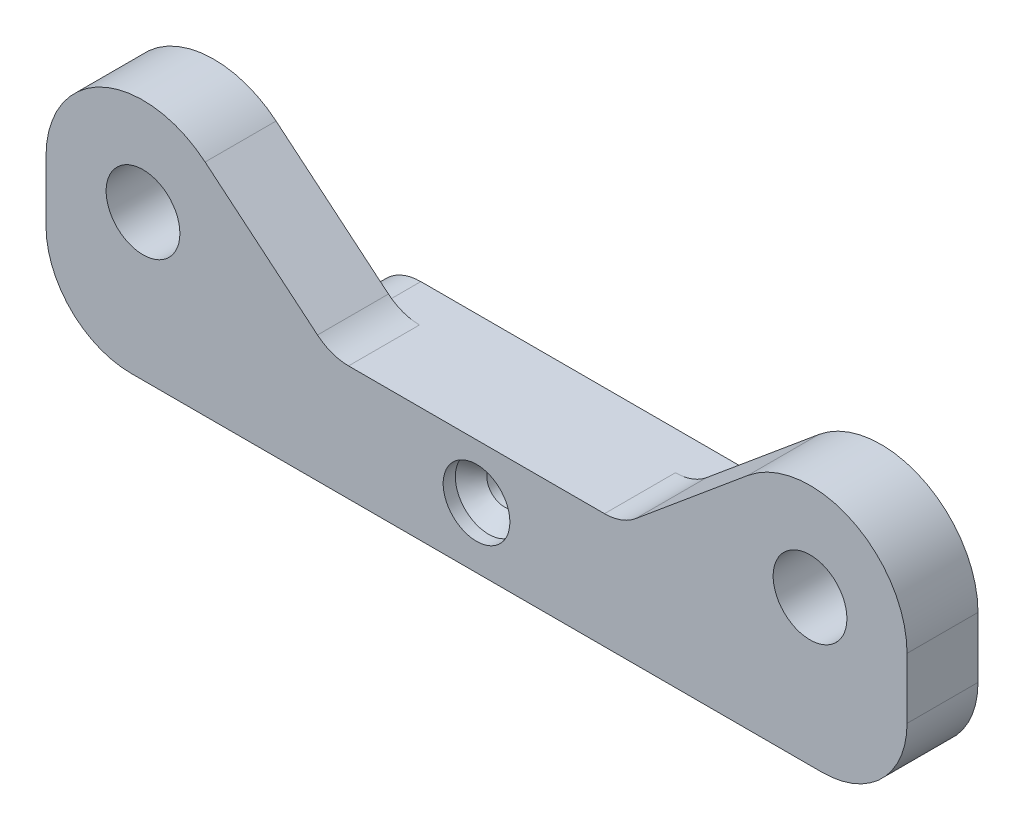
ISO-10303-21;
HEADER;
FILE_DESCRIPTION(('STEP AP214'),'2;1');
FILE_NAME('part.step','',(''),(''),'','','');
FILE_SCHEMA(('AUTOMOTIVE_DESIGN { 1 0 10303 214 1 1 1 1 }'));
ENDSEC;
DATA;
#1=APPLICATION_CONTEXT('core data for automotive mechanical design processes');
#2=APPLICATION_PROTOCOL_DEFINITION('international standard','automotive_design',2000,#1);
#3=PRODUCT_CONTEXT('',#1,'mechanical');
#4=PRODUCT('Part','Part','',(#3));
#5=PRODUCT_RELATED_PRODUCT_CATEGORY('part','',(#4));
#6=PRODUCT_DEFINITION_FORMATION('','',#4);
#7=PRODUCT_DEFINITION_CONTEXT('part definition',#1,'design');
#8=PRODUCT_DEFINITION('design','',#6,#7);
#9=PRODUCT_DEFINITION_SHAPE('','',#8);
#10=(LENGTH_UNIT() NAMED_UNIT(*) SI_UNIT(.MILLI.,.METRE.));
#11=(NAMED_UNIT(*) PLANE_ANGLE_UNIT() SI_UNIT($,.RADIAN.));
#12=(NAMED_UNIT(*) SI_UNIT($,.STERADIAN.) SOLID_ANGLE_UNIT());
#13=UNCERTAINTY_MEASURE_WITH_UNIT(LENGTH_MEASURE(1.E-05),#10,'distance_accuracy_value','');
#14=(GEOMETRIC_REPRESENTATION_CONTEXT(3) GLOBAL_UNCERTAINTY_ASSIGNED_CONTEXT((#13)) GLOBAL_UNIT_ASSIGNED_CONTEXT((#10,
#11,#12)) REPRESENTATION_CONTEXT('',''));
#15=CARTESIAN_POINT('',(0.,0.,0.));
#16=DIRECTION('',(0.,0.,1.));
#17=DIRECTION('',(1.,0.,0.));
#18=AXIS2_PLACEMENT_3D('',#15,#16,#17);
#19=CARTESIAN_POINT('',(15.,0.,9.));
#20=DIRECTION('',(0.,0.,1.));
#21=DIRECTION('',(1.,0.,0.));
#22=AXIS2_PLACEMENT_3D('',#19,#20,#21);
#23=CYLINDRICAL_SURFACE('',#22,0.999999999999997);
#24=CARTESIAN_POINT('',(15.,0.,0.));
#25=DIRECTION('',(0.,0.,-1.));
#26=DIRECTION('',(-1.,0.,0.));
#27=AXIS2_PLACEMENT_3D('',#24,#25,#26);
#28=CIRCLE('',#27,0.999999999999997);
#29=CARTESIAN_POINT('',(14.,0.,0.));
#30=VERTEX_POINT('',#29);
#31=EDGE_CURVE('E308',#30,#30,#28,.T.);
#32=ORIENTED_EDGE('',*,*,#31,.T.);
#33=EDGE_LOOP('',(#32));
#34=FACE_BOUND('',#33,.T.);
#35=CARTESIAN_POINT('',(15.,0.,7.));
#36=DIRECTION('',(0.,0.,1.));
#37=DIRECTION('',(1.,0.,0.));
#38=AXIS2_PLACEMENT_3D('',#35,#36,#37);
#39=CIRCLE('',#38,0.999999999999997);
#40=CARTESIAN_POINT('',(16.,0.,7.));
#41=VERTEX_POINT('',#40);
#42=EDGE_CURVE('E347',#41,#41,#39,.F.);
#43=ORIENTED_EDGE('',*,*,#42,.F.);
#44=EDGE_LOOP('',(#43));
#45=FACE_BOUND('',#44,.T.);
#46=ADVANCED_FACE('F36',(#34,#45),#23,.F.);
#47=CARTESIAN_POINT('',(-15.,0.,9.));
#48=DIRECTION('',(0.,0.,1.));
#49=DIRECTION('',(1.,0.,0.));
#50=AXIS2_PLACEMENT_3D('',#47,#48,#49);
#51=CYLINDRICAL_SURFACE('',#50,0.999999999999994);
#52=CARTESIAN_POINT('',(-15.,0.,0.));
#53=DIRECTION('',(0.,0.,-1.));
#54=DIRECTION('',(-1.,0.,0.));
#55=AXIS2_PLACEMENT_3D('',#52,#53,#54);
#56=CIRCLE('',#55,0.999999999999994);
#57=CARTESIAN_POINT('',(-16.,0.,0.));
#58=VERTEX_POINT('',#57);
#59=EDGE_CURVE('E311',#58,#58,#56,.T.);
#60=ORIENTED_EDGE('',*,*,#59,.T.);
#61=EDGE_LOOP('',(#60));
#62=FACE_BOUND('',#61,.T.);
#63=CARTESIAN_POINT('',(-15.,0.,7.));
#64=DIRECTION('',(0.,0.,1.));
#65=DIRECTION('',(1.,0.,0.));
#66=AXIS2_PLACEMENT_3D('',#63,#64,#65);
#67=CIRCLE('',#66,0.999999999999994);
#68=CARTESIAN_POINT('',(-14.,0.,7.));
#69=VERTEX_POINT('',#68);
#70=EDGE_CURVE('E344',#69,#69,#67,.F.);
#71=ORIENTED_EDGE('',*,*,#70,.F.);
#72=EDGE_LOOP('',(#71));
#73=FACE_BOUND('',#72,.T.);
#74=ADVANCED_FACE('F511',(#62,#73),#51,.F.);
#75=CARTESIAN_POINT('',(33.75,-3.5,3.15));
#76=DIRECTION('',(0.,0.,1.));
#77=DIRECTION('',(1.,0.,0.));
#78=AXIS2_PLACEMENT_3D('',#75,#76,#77);
#79=PLANE('',#78);
#80=DIRECTION('',(0.,-1.,0.));
#81=VECTOR('',#80,1.);
#82=CARTESIAN_POINT('',(35.5,7.,3.15000000000001));
#83=LINE('',#82,#81);
#84=CARTESIAN_POINT('',(35.5,7.,3.15000000000001));
#85=VERTEX_POINT('',#84);
#86=CARTESIAN_POINT('',(35.5,2.,3.15000000000001));
#87=VERTEX_POINT('',#86);
#88=EDGE_CURVE('E257',#85,#87,#83,.T.);
#89=ORIENTED_EDGE('',*,*,#88,.T.);
#90=CARTESIAN_POINT('',(28.5,2.,3.15));
#91=DIRECTION('',(0.,0.,1.));
#92=DIRECTION('',(1.,0.,0.));
#93=AXIS2_PLACEMENT_3D('',#90,#91,#92);
#94=CIRCLE('',#93,7.);
#95=CARTESIAN_POINT('',(28.5,-5.,3.15));
#96=VERTEX_POINT('',#95);
#97=EDGE_CURVE('E370',#87,#96,#94,.F.);
#98=ORIENTED_EDGE('',*,*,#97,.T.);
#99=DIRECTION('',(1.,0.,0.));
#100=VECTOR('',#99,1.);
#101=CARTESIAN_POINT('',(18.75,-5.,3.15));
#102=LINE('',#101,#100);
#103=CARTESIAN_POINT('',(13.5931457505076,-5.,3.14999999999999));
#104=VERTEX_POINT('',#103);
#105=EDGE_CURVE('E294',#104,#96,#102,.T.);
#106=ORIENTED_EDGE('',*,*,#105,.F.);
#107=CARTESIAN_POINT('',(13.5931457505076,-0.999999999999997,3.14999999999999));
#108=DIRECTION('',(0.,0.,1.));
#109=DIRECTION('',(1.,0.,0.));
#110=AXIS2_PLACEMENT_3D('',#107,#108,#109);
#111=CIRCLE('',#110,4.);
#112=CARTESIAN_POINT('',(16.4215728752538,-3.82842712474618,3.14999999999999));
#113=VERTEX_POINT('',#112);
#114=EDGE_CURVE('E439',#104,#113,#111,.T.);
#115=ORIENTED_EDGE('',*,*,#114,.T.);
#116=DIRECTION('',(0.707106781186546,0.707106781186549,0.));
#117=VECTOR('',#116,1.);
#118=CARTESIAN_POINT('',(25.25,5.00000000000001,3.15));
#119=LINE('',#118,#117);
#120=CARTESIAN_POINT('',(17.5784271247462,-2.67157287525378,3.15));
#121=VERTEX_POINT('',#120);
#122=EDGE_CURVE('E337',#113,#121,#119,.T.);
#123=ORIENTED_EDGE('',*,*,#122,.T.);
#124=CARTESIAN_POINT('',(14.75,0.156854249492402,3.14999999999999));
#125=DIRECTION('',(0.,0.,1.));
#126=DIRECTION('',(1.,0.,0.));
#127=AXIS2_PLACEMENT_3D('',#124,#125,#126);
#128=CIRCLE('',#127,4.);
#129=CARTESIAN_POINT('',(18.7292549076014,-0.249999999999993,3.15));
#130=VERTEX_POINT('',#129);
#131=EDGE_CURVE('E53',#121,#130,#128,.T.);
#132=ORIENTED_EDGE('',*,*,#131,.T.);
#133=CARTESIAN_POINT('',(14.75,-0.656854249492387,3.14999999999999));
#134=DIRECTION('',(0.,0.,1.));
#135=DIRECTION('',(1.,0.,0.));
#136=AXIS2_PLACEMENT_3D('',#133,#134,#135);
#137=CIRCLE('',#136,4.);
#138=CARTESIAN_POINT('',(17.5784271247462,2.1715728752538,3.15));
#139=VERTEX_POINT('',#138);
#140=EDGE_CURVE('E45',#130,#139,#137,.T.);
#141=ORIENTED_EDGE('',*,*,#140,.T.);
#142=DIRECTION('',(-0.707106781186547,0.707106781186548,0.));
#143=VECTOR('',#142,1.);
#144=CARTESIAN_POINT('',(28.5,-8.75000000000001,3.15));
#145=LINE('',#144,#143);
#146=CARTESIAN_POINT('',(16.4215728752538,3.32842712474619,3.14999999999999));
#147=VERTEX_POINT('',#146);
#148=EDGE_CURVE('E341',#139,#147,#145,.T.);
#149=ORIENTED_EDGE('',*,*,#148,.T.);
#150=CARTESIAN_POINT('',(13.5931457505076,0.500000000000002,3.14999999999999));
#151=DIRECTION('',(0.,0.,1.));
#152=DIRECTION('',(1.,0.,0.));
#153=AXIS2_PLACEMENT_3D('',#150,#151,#152);
#154=CIRCLE('',#153,4.);
#155=CARTESIAN_POINT('',(13.5931457505076,4.5,3.14999999999999));
#156=VERTEX_POINT('',#155);
#157=EDGE_CURVE('E11',#147,#156,#154,.T.);
#158=ORIENTED_EDGE('',*,*,#157,.T.);
#159=DIRECTION('',(-1.,0.,0.));
#160=VECTOR('',#159,1.);
#161=CARTESIAN_POINT('',(18.75,4.5,3.15));
#162=LINE('',#161,#160);
#163=CARTESIAN_POINT('',(10.5521862444409,4.5,3.14999999999999));
#164=VERTEX_POINT('',#163);
#165=EDGE_CURVE('E318',#156,#164,#162,.T.);
#166=ORIENTED_EDGE('',*,*,#165,.T.);
#167=CARTESIAN_POINT('',(10.5521862444409,8.5,3.14999999999999));
#168=DIRECTION('',(0.,0.,1.));
#169=DIRECTION('',(1.,0.,0.));
#170=AXIS2_PLACEMENT_3D('',#167,#168,#169);
#171=CIRCLE('',#170,4.);
#172=CARTESIAN_POINT('',(13.1123994730862,5.42667798239923,3.14999999999999));
#173=VERTEX_POINT('',#172);
#174=EDGE_CURVE('E363',#164,#173,#171,.T.);
#175=ORIENTED_EDGE('',*,*,#174,.T.);
#176=DIRECTION('',(0.768330504400193,0.640053307161321,0.));
#177=VECTOR('',#176,1.);
#178=CARTESIAN_POINT('',(22.3795735427094,13.1466440352015,3.15));
#179=LINE('',#178,#177);
#180=CARTESIAN_POINT('',(22.3795735427094,13.1466440352015,3.15));
#181=VERTEX_POINT('',#180);
#182=EDGE_CURVE('E236',#173,#181,#179,.T.);
#183=ORIENTED_EDGE('',*,*,#182,.T.);
#184=CARTESIAN_POINT('',(27.5,7.,3.15));
#185=DIRECTION('',(0.,0.,-1.));
#186=DIRECTION('',(-1.,0.,0.));
#187=AXIS2_PLACEMENT_3D('',#184,#185,#186);
#188=CIRCLE('',#187,8.);
#189=EDGE_CURVE('E267',#181,#85,#188,.T.);
#190=ORIENTED_EDGE('',*,*,#189,.T.);
#191=EDGE_LOOP('',(#89,#98,#106,#115,#123,#132,#141,#149,#158,#166,#175,#183,#190));
#192=FACE_BOUND('',#191,.T.);
#193=CARTESIAN_POINT('',(27.5,7.,3.15));
#194=DIRECTION('',(0.,0.,1.));
#195=DIRECTION('',(1.,0.,0.));
#196=AXIS2_PLACEMENT_3D('',#193,#194,#195);
#197=CIRCLE('',#196,3.04);
#198=CARTESIAN_POINT('',(30.54,7.,3.15));
#199=VERTEX_POINT('',#198);
#200=EDGE_CURVE('E314',#199,#199,#197,.F.);
#201=ORIENTED_EDGE('',*,*,#200,.F.);
#202=EDGE_LOOP('',(#201));
#203=FACE_BOUND('',#202,.T.);
#204=ADVANCED_FACE('F456',(#192,#203),#79,.F.);
#205=CARTESIAN_POINT('',(-33.75,3.5,9.));
#206=DIRECTION('',(0.,0.,1.));
#207=DIRECTION('',(1.,0.,0.));
#208=AXIS2_PLACEMENT_3D('',#205,#206,#207);
#209=PLANE('',#208);
#210=DIRECTION('',(-1.,0.,0.));
#211=VECTOR('',#210,1.);
#212=CARTESIAN_POINT('',(33.75,-5.,9.));
#213=LINE('',#212,#211);
#214=CARTESIAN_POINT('',(28.5,-5.,9.));
#215=VERTEX_POINT('',#214);
#216=CARTESIAN_POINT('',(-28.5,-5.,9.));
#217=VERTEX_POINT('',#216);
#218=EDGE_CURVE('E297',#215,#217,#213,.T.);
#219=ORIENTED_EDGE('',*,*,#218,.F.);
#220=CARTESIAN_POINT('',(28.5,2.,9.));
#221=DIRECTION('',(0.,0.,1.));
#222=DIRECTION('',(1.,0.,0.));
#223=AXIS2_PLACEMENT_3D('',#220,#221,#222);
#224=CIRCLE('',#223,7.);
#225=CARTESIAN_POINT('',(35.5,2.,9.));
#226=VERTEX_POINT('',#225);
#227=EDGE_CURVE('E379',#215,#226,#224,.T.);
#228=ORIENTED_EDGE('',*,*,#227,.T.);
#229=DIRECTION('',(0.,-1.,0.));
#230=VECTOR('',#229,1.);
#231=CARTESIAN_POINT('',(35.5,7.,9.));
#232=LINE('',#231,#230);
#233=CARTESIAN_POINT('',(35.5,7.,9.));
#234=VERTEX_POINT('',#233);
#235=EDGE_CURVE('E260',#234,#226,#232,.T.);
#236=ORIENTED_EDGE('',*,*,#235,.F.);
#237=CARTESIAN_POINT('',(27.5,7.,9.));
#238=DIRECTION('',(0.,0.,1.));
#239=DIRECTION('',(1.,0.,0.));
#240=AXIS2_PLACEMENT_3D('',#237,#238,#239);
#241=CIRCLE('',#240,8.);
#242=CARTESIAN_POINT('',(22.3795735427094,13.1466440352015,9.));
#243=VERTEX_POINT('',#242);
#244=EDGE_CURVE('E265',#243,#234,#241,.F.);
#245=ORIENTED_EDGE('',*,*,#244,.F.);
#246=DIRECTION('',(0.768330504400193,0.640053307161321,0.));
#247=VECTOR('',#246,1.);
#248=CARTESIAN_POINT('',(22.3795735427094,13.1466440352015,9.));
#249=LINE('',#248,#247);
#250=CARTESIAN_POINT('',(13.1123994730862,5.42667798239923,9.));
#251=VERTEX_POINT('',#250);
#252=EDGE_CURVE('E247',#251,#243,#249,.T.);
#253=ORIENTED_EDGE('',*,*,#252,.F.);
#254=CARTESIAN_POINT('',(10.5521862444409,8.5,9.));
#255=DIRECTION('',(0.,0.,1.));
#256=DIRECTION('',(1.,0.,0.));
#257=AXIS2_PLACEMENT_3D('',#254,#255,#256);
#258=CIRCLE('',#257,4.);
#259=CARTESIAN_POINT('',(10.5521862444409,4.5,9.));
#260=VERTEX_POINT('',#259);
#261=EDGE_CURVE('E365',#251,#260,#258,.F.);
#262=ORIENTED_EDGE('',*,*,#261,.T.);
#263=DIRECTION('',(1.,0.,0.));
#264=VECTOR('',#263,1.);
#265=CARTESIAN_POINT('',(-21.25,4.5,9.));
#266=LINE('',#265,#264);
#267=CARTESIAN_POINT('',(-10.5521862444409,4.5,9.));
#268=VERTEX_POINT('',#267);
#269=EDGE_CURVE('E276',#268,#260,#266,.T.);
#270=ORIENTED_EDGE('',*,*,#269,.F.);
#271=CARTESIAN_POINT('',(-10.5521862444409,8.5,9.));
#272=DIRECTION('',(0.,0.,1.));
#273=DIRECTION('',(1.,0.,0.));
#274=AXIS2_PLACEMENT_3D('',#271,#272,#273);
#275=CIRCLE('',#274,4.);
#276=CARTESIAN_POINT('',(-13.1123994730862,5.42667798239922,9.));
#277=VERTEX_POINT('',#276);
#278=EDGE_CURVE('E232',#268,#277,#275,.F.);
#279=ORIENTED_EDGE('',*,*,#278,.T.);
#280=DIRECTION('',(0.768330504400194,-0.640053307161321,0.));
#281=VECTOR('',#280,1.);
#282=CARTESIAN_POINT('',(-22.3795735427095,13.1466440352016,9.));
#283=LINE('',#282,#281);
#284=CARTESIAN_POINT('',(-22.3795735427095,13.1466440352015,9.));
#285=VERTEX_POINT('',#284);
#286=EDGE_CURVE('E226',#285,#277,#283,.T.);
#287=ORIENTED_EDGE('',*,*,#286,.F.);
#288=CARTESIAN_POINT('',(-27.5,7.,9.));
#289=DIRECTION('',(0.,0.,1.));
#290=DIRECTION('',(1.,0.,0.));
#291=AXIS2_PLACEMENT_3D('',#288,#289,#290);
#292=CIRCLE('',#291,8.);
#293=CARTESIAN_POINT('',(-35.5,7.,9.));
#294=VERTEX_POINT('',#293);
#295=EDGE_CURVE('E211',#294,#285,#292,.F.);
#296=ORIENTED_EDGE('',*,*,#295,.F.);
#297=DIRECTION('',(0.,1.,0.));
#298=VECTOR('',#297,1.);
#299=CARTESIAN_POINT('',(-35.5,7.,9.));
#300=LINE('',#299,#298);
#301=CARTESIAN_POINT('',(-35.5,2.,9.));
#302=VERTEX_POINT('',#301);
#303=EDGE_CURVE('E254',#302,#294,#300,.T.);
#304=ORIENTED_EDGE('',*,*,#303,.F.);
#305=CARTESIAN_POINT('',(-28.5,2.,9.));
#306=DIRECTION('',(0.,0.,1.));
#307=DIRECTION('',(1.,0.,0.));
#308=AXIS2_PLACEMENT_3D('',#305,#306,#307);
#309=CIRCLE('',#308,7.);
#310=EDGE_CURVE('E377',#302,#217,#309,.T.);
#311=ORIENTED_EDGE('',*,*,#310,.T.);
#312=EDGE_LOOP('',(#219,#228,#236,#245,#253,#262,#270,#279,#287,#296,#304,#311));
#313=FACE_BOUND('',#312,.T.);
#314=CARTESIAN_POINT('',(0.,0.,9.));
#315=DIRECTION('',(0.,0.,1.));
#316=DIRECTION('',(1.,0.,0.));
#317=AXIS2_PLACEMENT_3D('',#314,#315,#316);
#318=CIRCLE('',#317,2.75);
#319=CARTESIAN_POINT('',(2.75,0.,9.));
#320=VERTEX_POINT('',#319);
#321=EDGE_CURVE('E279',#320,#320,#318,.T.);
#322=ORIENTED_EDGE('',*,*,#321,.F.);
#323=EDGE_LOOP('',(#322));
#324=FACE_BOUND('',#323,.T.);
#325=CARTESIAN_POINT('',(27.5,7.,9.));
#326=DIRECTION('',(0.,0.,1.));
#327=DIRECTION('',(1.,0.,0.));
#328=AXIS2_PLACEMENT_3D('',#325,#326,#327);
#329=CIRCLE('',#328,3.04);
#330=CARTESIAN_POINT('',(30.54,7.,9.));
#331=VERTEX_POINT('',#330);
#332=EDGE_CURVE('E305',#331,#331,#329,.F.);
#333=ORIENTED_EDGE('',*,*,#332,.T.);
#334=EDGE_LOOP('',(#333));
#335=FACE_BOUND('',#334,.T.);
#336=CARTESIAN_POINT('',(-27.5,7.,9.));
#337=DIRECTION('',(0.,0.,1.));
#338=DIRECTION('',(1.,0.,0.));
#339=AXIS2_PLACEMENT_3D('',#336,#337,#338);
#340=CIRCLE('',#339,3.04);
#341=CARTESIAN_POINT('',(-24.46,7.,9.));
#342=VERTEX_POINT('',#341);
#343=EDGE_CURVE('E302',#342,#342,#340,.T.);
#344=ORIENTED_EDGE('',*,*,#343,.F.);
#345=EDGE_LOOP('',(#344));
#346=FACE_BOUND('',#345,.T.);
#347=ADVANCED_FACE('F228',(#313,#324,#335,#346),#209,.T.);
#348=CARTESIAN_POINT('',(-27.5,7.,22.));
#349=DIRECTION('',(0.,0.,-1.));
#350=DIRECTION('',(-1.,0.,0.));
#351=AXIS2_PLACEMENT_3D('',#348,#349,#350);
#352=CYLINDRICAL_SURFACE('',#351,3.04);
#353=CARTESIAN_POINT('',(-27.5,7.,3.15));
#354=DIRECTION('',(0.,0.,1.));
#355=DIRECTION('',(1.,0.,0.));
#356=AXIS2_PLACEMENT_3D('',#353,#354,#355);
#357=CIRCLE('',#356,3.04);
#358=CARTESIAN_POINT('',(-24.46,7.,3.15));
#359=VERTEX_POINT('',#358);
#360=EDGE_CURVE('E315',#359,#359,#357,.F.);
#361=ORIENTED_EDGE('',*,*,#360,.T.);
#362=EDGE_LOOP('',(#361));
#363=FACE_BOUND('',#362,.T.);
#364=ORIENTED_EDGE('',*,*,#343,.T.);
#365=EDGE_LOOP('',(#364));
#366=FACE_BOUND('',#365,.T.);
#367=ADVANCED_FACE('F531',(#363,#366),#352,.F.);
#368=CARTESIAN_POINT('',(27.5,7.,22.));
#369=DIRECTION('',(0.,0.,-1.));
#370=DIRECTION('',(-1.,0.,0.));
#371=AXIS2_PLACEMENT_3D('',#368,#369,#370);
#372=CYLINDRICAL_SURFACE('',#371,3.04);
#373=ORIENTED_EDGE('',*,*,#200,.T.);
#374=EDGE_LOOP('',(#373));
#375=FACE_BOUND('',#374,.T.);
#376=ORIENTED_EDGE('',*,*,#332,.F.);
#377=EDGE_LOOP('',(#376));
#378=FACE_BOUND('',#377,.T.);
#379=ADVANCED_FACE('F528',(#375,#378),#372,.F.);
#380=CARTESIAN_POINT('',(-33.75,-3.50000000000001,3.15));
#381=DIRECTION('',(0.,0.,1.));
#382=DIRECTION('',(1.,0.,0.));
#383=AXIS2_PLACEMENT_3D('',#380,#381,#382);
#384=PLANE('',#383);
#385=DIRECTION('',(1.,0.,0.));
#386=VECTOR('',#385,1.);
#387=CARTESIAN_POINT('',(-33.75,-5.,3.15));
#388=LINE('',#387,#386);
#389=CARTESIAN_POINT('',(-28.5,-5.,3.15));
#390=VERTEX_POINT('',#389);
#391=CARTESIAN_POINT('',(-13.5931457505076,-5.,3.15000000000001));
#392=VERTEX_POINT('',#391);
#393=EDGE_CURVE('E300',#390,#392,#388,.T.);
#394=ORIENTED_EDGE('',*,*,#393,.F.);
#395=CARTESIAN_POINT('',(-28.5,2.,3.15));
#396=DIRECTION('',(0.,0.,1.));
#397=DIRECTION('',(1.,0.,0.));
#398=AXIS2_PLACEMENT_3D('',#395,#396,#397);
#399=CIRCLE('',#398,7.);
#400=CARTESIAN_POINT('',(-35.5,2.,3.14999999999996));
#401=VERTEX_POINT('',#400);
#402=EDGE_CURVE('E381',#390,#401,#399,.F.);
#403=ORIENTED_EDGE('',*,*,#402,.T.);
#404=DIRECTION('',(0.,1.,0.));
#405=VECTOR('',#404,1.);
#406=CARTESIAN_POINT('',(-35.5,7.,3.14999999999996));
#407=LINE('',#406,#405);
#408=CARTESIAN_POINT('',(-35.5,7.,3.14999999999996));
#409=VERTEX_POINT('',#408);
#410=EDGE_CURVE('E252',#401,#409,#407,.T.);
#411=ORIENTED_EDGE('',*,*,#410,.T.);
#412=CARTESIAN_POINT('',(-27.5,7.,3.14999999999997));
#413=DIRECTION('',(0.,0.,-1.));
#414=DIRECTION('',(1.,0.,0.));
#415=AXIS2_PLACEMENT_3D('',#412,#413,#414);
#416=CIRCLE('',#415,8.);
#417=CARTESIAN_POINT('',(-22.3795735427095,13.1466440352015,3.14999999999997));
#418=VERTEX_POINT('',#417);
#419=EDGE_CURVE('E222',#409,#418,#416,.T.);
#420=ORIENTED_EDGE('',*,*,#419,.T.);
#421=DIRECTION('',(0.768330504400193,-0.640053307161321,0.));
#422=VECTOR('',#421,1.);
#423=CARTESIAN_POINT('',(-22.3795735427094,13.1466440352015,3.14999999999997));
#424=LINE('',#423,#422);
#425=CARTESIAN_POINT('',(-13.1123994730862,5.42667798239923,3.14999999999998));
#426=VERTEX_POINT('',#425);
#427=EDGE_CURVE('E241',#418,#426,#424,.T.);
#428=ORIENTED_EDGE('',*,*,#427,.T.);
#429=CARTESIAN_POINT('',(-10.5521862444409,8.5,3.15));
#430=DIRECTION('',(0.,0.,1.));
#431=DIRECTION('',(1.,0.,0.));
#432=AXIS2_PLACEMENT_3D('',#429,#430,#431);
#433=CIRCLE('',#432,4.);
#434=CARTESIAN_POINT('',(-10.5521862444409,4.5,3.14999999999998));
#435=VERTEX_POINT('',#434);
#436=EDGE_CURVE('E359',#426,#435,#433,.T.);
#437=ORIENTED_EDGE('',*,*,#436,.T.);
#438=DIRECTION('',(-1.,0.,0.));
#439=VECTOR('',#438,1.);
#440=CARTESIAN_POINT('',(-12.,4.5,3.14999999999998));
#441=LINE('',#440,#439);
#442=CARTESIAN_POINT('',(-13.5931457505076,4.5,3.14999999999998));
#443=VERTEX_POINT('',#442);
#444=EDGE_CURVE('E269',#435,#443,#441,.T.);
#445=ORIENTED_EDGE('',*,*,#444,.T.);
#446=CARTESIAN_POINT('',(-13.5931457505076,0.499999999999999,3.15));
#447=DIRECTION('',(0.,0.,1.));
#448=DIRECTION('',(1.,0.,0.));
#449=AXIS2_PLACEMENT_3D('',#446,#447,#448);
#450=CIRCLE('',#449,4.);
#451=CARTESIAN_POINT('',(-16.4215728752538,3.32842712474619,3.15));
#452=VERTEX_POINT('',#451);
#453=EDGE_CURVE('E434',#443,#452,#450,.T.);
#454=ORIENTED_EDGE('',*,*,#453,.T.);
#455=DIRECTION('',(-0.707106781186546,-0.707106781186549,0.));
#456=VECTOR('',#455,1.);
#457=CARTESIAN_POINT('',(-28.5,-8.75000000000003,3.15));
#458=LINE('',#457,#456);
#459=CARTESIAN_POINT('',(-17.5784271247462,2.17157287525378,3.15));
#460=VERTEX_POINT('',#459);
#461=EDGE_CURVE('E339',#452,#460,#458,.T.);
#462=ORIENTED_EDGE('',*,*,#461,.T.);
#463=CARTESIAN_POINT('',(-14.75,-0.656854249492401,3.15));
#464=DIRECTION('',(0.,0.,1.));
#465=DIRECTION('',(1.,0.,0.));
#466=AXIS2_PLACEMENT_3D('',#463,#464,#465);
#467=CIRCLE('',#466,4.);
#468=CARTESIAN_POINT('',(-18.7292549076014,-0.250000000000006,3.15));
#469=VERTEX_POINT('',#468);
#470=EDGE_CURVE('E61',#460,#469,#467,.T.);
#471=ORIENTED_EDGE('',*,*,#470,.T.);
#472=CARTESIAN_POINT('',(-14.75,0.156854249492389,3.15));
#473=DIRECTION('',(0.,0.,1.));
#474=DIRECTION('',(1.,0.,0.));
#475=AXIS2_PLACEMENT_3D('',#472,#473,#474);
#476=CIRCLE('',#475,4.);
#477=CARTESIAN_POINT('',(-17.5784271247462,-2.6715728752538,3.15));
#478=VERTEX_POINT('',#477);
#479=EDGE_CURVE('E431',#469,#478,#476,.T.);
#480=ORIENTED_EDGE('',*,*,#479,.T.);
#481=DIRECTION('',(0.707106781186547,-0.707106781186548,0.));
#482=VECTOR('',#481,1.);
#483=CARTESIAN_POINT('',(-25.25,5.,3.15));
#484=LINE('',#483,#482);
#485=CARTESIAN_POINT('',(-16.4215728752538,-3.82842712474619,3.15));
#486=VERTEX_POINT('',#485);
#487=EDGE_CURVE('E334',#478,#486,#484,.T.);
#488=ORIENTED_EDGE('',*,*,#487,.T.);
#489=CARTESIAN_POINT('',(-13.5931457505076,-1.,3.15));
#490=DIRECTION('',(0.,0.,1.));
#491=DIRECTION('',(1.,0.,0.));
#492=AXIS2_PLACEMENT_3D('',#489,#490,#491);
#493=CIRCLE('',#492,4.);
#494=EDGE_CURVE('E436',#486,#392,#493,.T.);
#495=ORIENTED_EDGE('',*,*,#494,.T.);
#496=EDGE_LOOP('',(#394,#403,#411,#420,#428,#437,#445,#454,#462,#471,#480,#488,#495));
#497=FACE_BOUND('',#496,.T.);
#498=ORIENTED_EDGE('',*,*,#360,.F.);
#499=EDGE_LOOP('',(#498));
#500=FACE_BOUND('',#499,.T.);
#501=ADVANCED_FACE('F526',(#497,#500),#384,.F.);
#502=CARTESIAN_POINT('',(15.,13.5,0.));
#503=DIRECTION('',(0.,0.,-1.));
#504=DIRECTION('',(-1.,0.,0.));
#505=AXIS2_PLACEMENT_3D('',#502,#503,#504);
#506=PLANE('',#505);
#507=CARTESIAN_POINT('',(0.,0.,0.));
#508=DIRECTION('',(0.,0.,1.));
#509=DIRECTION('',(1.,0.,0.));
#510=AXIS2_PLACEMENT_3D('',#507,#508,#509);
#511=CIRCLE('',#510,1.45);
#512=CARTESIAN_POINT('',(1.45,0.,0.));
#513=VERTEX_POINT('',#512);
#514=EDGE_CURVE('E288',#513,#513,#511,.T.);
#515=ORIENTED_EDGE('',*,*,#514,.T.);
#516=EDGE_LOOP('',(#515));
#517=FACE_BOUND('',#516,.T.);
#518=ORIENTED_EDGE('',*,*,#31,.F.);
#519=EDGE_LOOP('',(#518));
#520=FACE_BOUND('',#519,.T.);
#521=ORIENTED_EDGE('',*,*,#59,.F.);
#522=EDGE_LOOP('',(#521));
#523=FACE_BOUND('',#522,.T.);
#524=DIRECTION('',(-0.707106781186547,0.707106781186548,0.));
#525=VECTOR('',#524,1.);
#526=CARTESIAN_POINT('',(-9.37500000000004,-10.875,0.));
#527=LINE('',#526,#525);
#528=CARTESIAN_POINT('',(-16.4215728752538,-3.82842712474619,0.));
#529=VERTEX_POINT('',#528);
#530=CARTESIAN_POINT('',(-17.5784271247462,-2.6715728752538,0.));
#531=VERTEX_POINT('',#530);
#532=EDGE_CURVE('E331',#529,#531,#527,.T.);
#533=ORIENTED_EDGE('',*,*,#532,.T.);
#534=CARTESIAN_POINT('',(-14.75,0.156854249492389,0.));
#535=DIRECTION('',(0.,0.,-1.));
#536=DIRECTION('',(-1.,0.,0.));
#537=AXIS2_PLACEMENT_3D('',#534,#535,#536);
#538=CIRCLE('',#537,4.);
#539=CARTESIAN_POINT('',(-18.7292549076014,-0.250000000000006,0.));
#540=VERTEX_POINT('',#539);
#541=EDGE_CURVE('E404',#531,#540,#538,.T.);
#542=ORIENTED_EDGE('',*,*,#541,.T.);
#543=CARTESIAN_POINT('',(-14.75,-0.656854249492401,0.));
#544=DIRECTION('',(0.,0.,-1.));
#545=DIRECTION('',(-1.,0.,0.));
#546=AXIS2_PLACEMENT_3D('',#543,#544,#545);
#547=CIRCLE('',#546,4.);
#548=CARTESIAN_POINT('',(-17.5784271247462,2.17157287525378,0.));
#549=VERTEX_POINT('',#548);
#550=EDGE_CURVE('E402',#540,#549,#547,.T.);
#551=ORIENTED_EDGE('',*,*,#550,.T.);
#552=DIRECTION('',(0.707106781186546,0.707106781186549,0.));
#553=VECTOR('',#552,1.);
#554=CARTESIAN_POINT('',(4.37499999999994,24.125,0.));
#555=LINE('',#554,#553);
#556=CARTESIAN_POINT('',(-16.4215728752538,3.32842712474618,0.));
#557=VERTEX_POINT('',#556);
#558=EDGE_CURVE('E325',#549,#557,#555,.T.);
#559=ORIENTED_EDGE('',*,*,#558,.T.);
#560=CARTESIAN_POINT('',(-13.5931457505076,0.499999999999999,0.));
#561=DIRECTION('',(0.,0.,-1.));
#562=DIRECTION('',(-1.,0.,0.));
#563=AXIS2_PLACEMENT_3D('',#560,#561,#562);
#564=CIRCLE('',#563,4.);
#565=CARTESIAN_POINT('',(-13.5931457505076,4.5,0.));
#566=VERTEX_POINT('',#565);
#567=EDGE_CURVE('E400',#557,#566,#564,.T.);
#568=ORIENTED_EDGE('',*,*,#567,.T.);
#569=DIRECTION('',(-1.,0.,0.));
#570=VECTOR('',#569,1.);
#571=CARTESIAN_POINT('',(18.75,4.5,0.));
#572=LINE('',#571,#570);
#573=CARTESIAN_POINT('',(13.5931457505076,4.5,0.));
#574=VERTEX_POINT('',#573);
#575=EDGE_CURVE('E273',#574,#566,#572,.T.);
#576=ORIENTED_EDGE('',*,*,#575,.F.);
#577=CARTESIAN_POINT('',(13.5931457505076,0.500000000000002,0.));
#578=DIRECTION('',(0.,0.,-1.));
#579=DIRECTION('',(-1.,0.,0.));
#580=AXIS2_PLACEMENT_3D('',#577,#578,#579);
#581=CIRCLE('',#580,4.);
#582=CARTESIAN_POINT('',(16.4215728752538,3.32842712474619,0.));
#583=VERTEX_POINT('',#582);
#584=EDGE_CURVE('E390',#574,#583,#581,.T.);
#585=ORIENTED_EDGE('',*,*,#584,.T.);
#586=DIRECTION('',(0.707106781186547,-0.707106781186548,0.));
#587=VECTOR('',#586,1.);
#588=CARTESIAN_POINT('',(10.625,9.12500000000002,0.));
#589=LINE('',#588,#587);
#590=CARTESIAN_POINT('',(17.5784271247462,2.1715728752538,0.));
#591=VERTEX_POINT('',#590);
#592=EDGE_CURVE('E322',#583,#591,#589,.T.);
#593=ORIENTED_EDGE('',*,*,#592,.T.);
#594=CARTESIAN_POINT('',(14.75,-0.656854249492387,0.));
#595=DIRECTION('',(0.,0.,-1.));
#596=DIRECTION('',(-1.,0.,0.));
#597=AXIS2_PLACEMENT_3D('',#594,#595,#596);
#598=CIRCLE('',#597,4.);
#599=CARTESIAN_POINT('',(18.7292549076014,-0.249999999999993,0.));
#600=VERTEX_POINT('',#599);
#601=EDGE_CURVE('E392',#591,#600,#598,.T.);
#602=ORIENTED_EDGE('',*,*,#601,.T.);
#603=CARTESIAN_POINT('',(14.75,0.156854249492402,0.));
#604=DIRECTION('',(0.,0.,-1.));
#605=DIRECTION('',(-1.,0.,0.));
#606=AXIS2_PLACEMENT_3D('',#603,#604,#605);
#607=CIRCLE('',#606,4.);
#608=CARTESIAN_POINT('',(17.5784271247462,-2.67157287525378,0.));
#609=VERTEX_POINT('',#608);
#610=EDGE_CURVE('E394',#600,#609,#607,.T.);
#611=ORIENTED_EDGE('',*,*,#610,.T.);
#612=DIRECTION('',(-0.707106781186546,-0.707106781186549,0.));
#613=VECTOR('',#612,1.);
#614=CARTESIAN_POINT('',(24.375,4.12500000000003,0.));
#615=LINE('',#614,#613);
#616=CARTESIAN_POINT('',(16.4215728752538,-3.82842712474618,0.));
#617=VERTEX_POINT('',#616);
#618=EDGE_CURVE('E328',#609,#617,#615,.T.);
#619=ORIENTED_EDGE('',*,*,#618,.T.);
#620=CARTESIAN_POINT('',(13.5931457505076,-0.999999999999997,0.));
#621=DIRECTION('',(0.,0.,-1.));
#622=DIRECTION('',(-1.,0.,0.));
#623=AXIS2_PLACEMENT_3D('',#620,#621,#622);
#624=CIRCLE('',#623,4.);
#625=CARTESIAN_POINT('',(13.5931457505076,-5.,0.));
#626=VERTEX_POINT('',#625);
#627=EDGE_CURVE('E396',#617,#626,#624,.T.);
#628=ORIENTED_EDGE('',*,*,#627,.T.);
#629=DIRECTION('',(1.,0.,0.));
#630=VECTOR('',#629,1.);
#631=CARTESIAN_POINT('',(-18.75,-5.,0.));
#632=LINE('',#631,#630);
#633=CARTESIAN_POINT('',(-13.5931457505076,-5.,0.));
#634=VERTEX_POINT('',#633);
#635=EDGE_CURVE('E291',#634,#626,#632,.T.);
#636=ORIENTED_EDGE('',*,*,#635,.F.);
#637=CARTESIAN_POINT('',(-13.5931457505076,-1.,0.));
#638=DIRECTION('',(0.,0.,-1.));
#639=DIRECTION('',(-1.,0.,0.));
#640=AXIS2_PLACEMENT_3D('',#637,#638,#639);
#641=CIRCLE('',#640,4.);
#642=EDGE_CURVE('E398',#634,#529,#641,.T.);
#643=ORIENTED_EDGE('',*,*,#642,.T.);
#644=EDGE_LOOP('',(#533,#542,#551,#559,#568,#576,#585,#593,#602,#611,#619,#628,#636,#643));
#645=FACE_BOUND('',#644,.T.);
#646=ADVANCED_FACE('F523',(#517,#520,#523,#645),#506,.T.);
#647=CARTESIAN_POINT('',(-18.75,-5.,0.));
#648=DIRECTION('',(0.,-1.,0.));
#649=DIRECTION('',(1.,0.,0.));
#650=AXIS2_PLACEMENT_3D('',#647,#648,#649);
#651=PLANE('',#650);
#652=ORIENTED_EDGE('',*,*,#393,.T.);
#653=DIRECTION('',(0.,0.,-1.));
#654=VECTOR('',#653,1.);
#655=CARTESIAN_POINT('',(-13.5931457505076,-5.,0.));
#656=LINE('',#655,#654);
#657=EDGE_CURVE('E419',#392,#634,#656,.T.);
#658=ORIENTED_EDGE('',*,*,#657,.T.);
#659=ORIENTED_EDGE('',*,*,#635,.T.);
#660=DIRECTION('',(0.,0.,1.));
#661=VECTOR('',#660,1.);
#662=CARTESIAN_POINT('',(13.5931457505076,-5.,0.));
#663=LINE('',#662,#661);
#664=EDGE_CURVE('E416',#626,#104,#663,.T.);
#665=ORIENTED_EDGE('',*,*,#664,.T.);
#666=ORIENTED_EDGE('',*,*,#105,.T.);
#667=DIRECTION('',(0.,0.,-1.));
#668=VECTOR('',#667,1.);
#669=CARTESIAN_POINT('',(28.5,-5.,0.));
#670=LINE('',#669,#668);
#671=EDGE_CURVE('E375',#96,#215,#670,.F.);
#672=ORIENTED_EDGE('',*,*,#671,.T.);
#673=ORIENTED_EDGE('',*,*,#218,.T.);
#674=DIRECTION('',(0.,0.,-1.));
#675=VECTOR('',#674,1.);
#676=CARTESIAN_POINT('',(-28.5,-5.,0.));
#677=LINE('',#676,#675);
#678=EDGE_CURVE('E372',#217,#390,#677,.T.);
#679=ORIENTED_EDGE('',*,*,#678,.T.);
#680=EDGE_LOOP('',(#652,#658,#659,#665,#666,#672,#673,#679));
#681=FACE_BOUND('',#680,.T.);
#682=ADVANCED_FACE('F495',(#681),#651,.T.);
#683=CARTESIAN_POINT('',(0.,0.,9.));
#684=DIRECTION('',(0.,0.,1.));
#685=DIRECTION('',(1.,0.,0.));
#686=AXIS2_PLACEMENT_3D('',#683,#684,#685);
#687=CYLINDRICAL_SURFACE('',#686,1.45);
#688=ORIENTED_EDGE('',*,*,#514,.F.);
#689=EDGE_LOOP('',(#688));
#690=FACE_BOUND('',#689,.T.);
#691=CARTESIAN_POINT('',(0.,0.,6.7));
#692=DIRECTION('',(0.,0.,1.));
#693=DIRECTION('',(1.,0.,0.));
#694=AXIS2_PLACEMENT_3D('',#691,#692,#693);
#695=CIRCLE('',#694,1.45);
#696=CARTESIAN_POINT('',(1.45,0.,6.7));
#697=VERTEX_POINT('',#696);
#698=EDGE_CURVE('E285',#697,#697,#695,.T.);
#699=ORIENTED_EDGE('',*,*,#698,.T.);
#700=EDGE_LOOP('',(#699));
#701=FACE_BOUND('',#700,.T.);
#702=ADVANCED_FACE('F698',(#690,#701),#687,.F.);
#703=CARTESIAN_POINT('',(0.,0.,8.));
#704=DIRECTION('',(0.,0.,1.));
#705=DIRECTION('',(1.,0.,0.));
#706=AXIS2_PLACEMENT_3D('',#703,#704,#705);
#707=CONICAL_SURFACE('',#706,2.75,0.785398163397448);
#708=ORIENTED_EDGE('',*,*,#698,.F.);
#709=EDGE_LOOP('',(#708));
#710=FACE_BOUND('',#709,.T.);
#711=CARTESIAN_POINT('',(0.,0.,8.));
#712=DIRECTION('',(0.,0.,1.));
#713=DIRECTION('',(1.,0.,0.));
#714=AXIS2_PLACEMENT_3D('',#711,#712,#713);
#715=CIRCLE('',#714,2.75);
#716=CARTESIAN_POINT('',(2.75,0.,8.));
#717=VERTEX_POINT('',#716);
#718=EDGE_CURVE('E282',#717,#717,#715,.T.);
#719=ORIENTED_EDGE('',*,*,#718,.T.);
#720=EDGE_LOOP('',(#719));
#721=FACE_BOUND('',#720,.T.);
#722=ADVANCED_FACE('F837',(#710,#721),#707,.F.);
#723=CARTESIAN_POINT('',(0.,0.,9.));
#724=DIRECTION('',(0.,0.,1.));
#725=DIRECTION('',(1.,0.,0.));
#726=AXIS2_PLACEMENT_3D('',#723,#724,#725);
#727=CYLINDRICAL_SURFACE('',#726,2.75);
#728=ORIENTED_EDGE('',*,*,#718,.F.);
#729=EDGE_LOOP('',(#728));
#730=FACE_BOUND('',#729,.T.);
#731=ORIENTED_EDGE('',*,*,#321,.T.);
#732=EDGE_LOOP('',(#731));
#733=FACE_BOUND('',#732,.T.);
#734=ADVANCED_FACE('F686',(#730,#733),#727,.F.);
#735=CARTESIAN_POINT('',(18.75,4.5,0.));
#736=DIRECTION('',(0.,1.,0.));
#737=DIRECTION('',(-1.,0.,0.));
#738=AXIS2_PLACEMENT_3D('',#735,#736,#737);
#739=PLANE('',#738);
#740=ORIENTED_EDGE('',*,*,#575,.T.);
#741=DIRECTION('',(0.,0.,1.));
#742=VECTOR('',#741,1.);
#743=CARTESIAN_POINT('',(-13.5931457505076,4.5,0.));
#744=LINE('',#743,#742);
#745=EDGE_CURVE('E413',#566,#443,#744,.T.);
#746=ORIENTED_EDGE('',*,*,#745,.T.);
#747=ORIENTED_EDGE('',*,*,#444,.F.);
#748=DIRECTION('',(0.,0.,-1.));
#749=VECTOR('',#748,1.);
#750=CARTESIAN_POINT('',(-10.5521862444409,4.5,9.));
#751=LINE('',#750,#749);
#752=EDGE_CURVE('E355',#435,#268,#751,.F.);
#753=ORIENTED_EDGE('',*,*,#752,.T.);
#754=ORIENTED_EDGE('',*,*,#269,.T.);
#755=DIRECTION('',(0.,0.,-1.));
#756=VECTOR('',#755,1.);
#757=CARTESIAN_POINT('',(10.5521862444409,4.5,3.14999999999999));
#758=LINE('',#757,#756);
#759=EDGE_CURVE('E352',#260,#164,#758,.T.);
#760=ORIENTED_EDGE('',*,*,#759,.T.);
#761=ORIENTED_EDGE('',*,*,#165,.F.);
#762=DIRECTION('',(0.,0.,-1.));
#763=VECTOR('',#762,1.);
#764=CARTESIAN_POINT('',(13.5931457505076,4.5,0.));
#765=LINE('',#764,#763);
#766=EDGE_CURVE('E410',#156,#574,#765,.T.);
#767=ORIENTED_EDGE('',*,*,#766,.T.);
#768=EDGE_LOOP('',(#740,#746,#747,#753,#754,#760,#761,#767));
#769=FACE_BOUND('',#768,.T.);
#770=ADVANCED_FACE('F468',(#769),#739,.T.);
#771=CARTESIAN_POINT('',(-15.25,-5.,0.));
#772=DIRECTION('',(-0.707106781186548,-0.707106781186547,0.));
#773=DIRECTION('',(0.707106781186547,-0.707106781186548,0.));
#774=AXIS2_PLACEMENT_3D('',#771,#772,#773);
#775=PLANE('',#774);
#776=ORIENTED_EDGE('',*,*,#487,.F.);
#777=DIRECTION('',(0.,0.,1.));
#778=VECTOR('',#777,1.);
#779=CARTESIAN_POINT('',(-17.5784271247462,-2.6715728752538,0.));
#780=LINE('',#779,#778);
#781=EDGE_CURVE('E387',#478,#531,#780,.F.);
#782=ORIENTED_EDGE('',*,*,#781,.T.);
#783=ORIENTED_EDGE('',*,*,#532,.F.);
#784=DIRECTION('',(0.,0.,-1.));
#785=VECTOR('',#784,1.);
#786=CARTESIAN_POINT('',(-16.4215728752538,-3.82842712474619,0.));
#787=LINE('',#786,#785);
#788=EDGE_CURVE('E385',#529,#486,#787,.F.);
#789=ORIENTED_EDGE('',*,*,#788,.T.);
#790=EDGE_LOOP('',(#776,#782,#783,#789));
#791=FACE_BOUND('',#790,.T.);
#792=ADVANCED_FACE('F542',(#791),#775,.T.);
#793=CARTESIAN_POINT('',(15.25,-5.,0.));
#794=DIRECTION('',(0.707106781186549,-0.707106781186546,0.));
#795=DIRECTION('',(0.707106781186546,0.707106781186549,0.));
#796=AXIS2_PLACEMENT_3D('',#793,#794,#795);
#797=PLANE('',#796);
#798=ORIENTED_EDGE('',*,*,#122,.F.);
#799=DIRECTION('',(0.,0.,1.));
#800=VECTOR('',#799,1.);
#801=CARTESIAN_POINT('',(16.4215728752538,-3.82842712474618,0.));
#802=LINE('',#801,#800);
#803=EDGE_CURVE('E425',#113,#617,#802,.F.);
#804=ORIENTED_EDGE('',*,*,#803,.T.);
#805=ORIENTED_EDGE('',*,*,#618,.F.);
#806=DIRECTION('',(0.,0.,-1.));
#807=VECTOR('',#806,1.);
#808=CARTESIAN_POINT('',(17.5784271247462,-2.67157287525378,3.15));
#809=LINE('',#808,#807);
#810=EDGE_CURVE('E422',#609,#121,#809,.F.);
#811=ORIENTED_EDGE('',*,*,#810,.T.);
#812=EDGE_LOOP('',(#798,#804,#805,#811));
#813=FACE_BOUND('',#812,.T.);
#814=ADVANCED_FACE('F545',(#813),#797,.T.);
#815=CARTESIAN_POINT('',(-15.25,4.5,0.));
#816=DIRECTION('',(-0.707106781186549,0.707106781186546,0.));
#817=DIRECTION('',(-0.707106781186546,-0.707106781186549,0.));
#818=AXIS2_PLACEMENT_3D('',#815,#816,#817);
#819=PLANE('',#818);
#820=ORIENTED_EDGE('',*,*,#558,.F.);
#821=DIRECTION('',(0.,0.,-1.));
#822=VECTOR('',#821,1.);
#823=CARTESIAN_POINT('',(-17.5784271247462,2.17157287525378,3.15));
#824=LINE('',#823,#822);
#825=EDGE_CURVE('E408',#549,#460,#824,.F.);
#826=ORIENTED_EDGE('',*,*,#825,.T.);
#827=ORIENTED_EDGE('',*,*,#461,.F.);
#828=DIRECTION('',(0.,0.,1.));
#829=VECTOR('',#828,1.);
#830=CARTESIAN_POINT('',(-16.4215728752538,3.32842712474618,0.));
#831=LINE('',#830,#829);
#832=EDGE_CURVE('E406',#452,#557,#831,.F.);
#833=ORIENTED_EDGE('',*,*,#832,.T.);
#834=EDGE_LOOP('',(#820,#826,#827,#833));
#835=FACE_BOUND('',#834,.T.);
#836=ADVANCED_FACE('F549',(#835),#819,.T.);
#837=CARTESIAN_POINT('',(15.25,4.5,0.));
#838=DIRECTION('',(0.707106781186548,0.707106781186547,0.));
#839=DIRECTION('',(-0.707106781186547,0.707106781186548,0.));
#840=AXIS2_PLACEMENT_3D('',#837,#838,#839);
#841=PLANE('',#840);
#842=ORIENTED_EDGE('',*,*,#148,.F.);
#843=DIRECTION('',(0.,0.,1.));
#844=VECTOR('',#843,1.);
#845=CARTESIAN_POINT('',(17.5784271247462,2.1715728752538,0.));
#846=LINE('',#845,#844);
#847=EDGE_CURVE('E429',#139,#591,#846,.F.);
#848=ORIENTED_EDGE('',*,*,#847,.T.);
#849=ORIENTED_EDGE('',*,*,#592,.F.);
#850=DIRECTION('',(0.,0.,-1.));
#851=VECTOR('',#850,1.);
#852=CARTESIAN_POINT('',(16.4215728752538,3.32842712474619,0.));
#853=LINE('',#852,#851);
#854=EDGE_CURVE('E427',#583,#147,#853,.F.);
#855=ORIENTED_EDGE('',*,*,#854,.T.);
#856=EDGE_LOOP('',(#842,#848,#849,#855));
#857=FACE_BOUND('',#856,.T.);
#858=ADVANCED_FACE('F460',(#857),#841,.T.);
#859=CARTESIAN_POINT('',(-15.,0.,7.));
#860=DIRECTION('',(0.,0.,1.));
#861=DIRECTION('',(1.,0.,0.));
#862=AXIS2_PLACEMENT_3D('',#859,#860,#861);
#863=PLANE('',#862);
#864=ORIENTED_EDGE('',*,*,#70,.T.);
#865=EDGE_LOOP('',(#864));
#866=FACE_BOUND('',#865,.T.);
#867=ADVANCED_FACE('F556',(#866),#863,.F.);
#868=CARTESIAN_POINT('',(15.,0.,7.));
#869=DIRECTION('',(0.,0.,1.));
#870=DIRECTION('',(1.,0.,0.));
#871=AXIS2_PLACEMENT_3D('',#868,#869,#870);
#872=PLANE('',#871);
#873=ORIENTED_EDGE('',*,*,#42,.T.);
#874=EDGE_LOOP('',(#873));
#875=FACE_BOUND('',#874,.T.);
#876=ADVANCED_FACE('F798',(#875),#872,.F.);
#877=CARTESIAN_POINT('',(27.5,7.,31.6274169979695));
#878=DIRECTION('',(0.,0.,-1.));
#879=DIRECTION('',(-1.,0.,0.));
#880=AXIS2_PLACEMENT_3D('',#877,#878,#879);
#881=CYLINDRICAL_SURFACE('',#880,8.);
#882=DIRECTION('',(0.,0.,-1.));
#883=VECTOR('',#882,1.);
#884=CARTESIAN_POINT('',(22.3795735427094,13.1466440352015,22.5092560861063));
#885=LINE('',#884,#883);
#886=EDGE_CURVE('E249',#243,#181,#885,.T.);
#887=ORIENTED_EDGE('',*,*,#886,.F.);
#888=ORIENTED_EDGE('',*,*,#244,.T.);
#889=DIRECTION('',(0.,0.,-1.));
#890=VECTOR('',#889,1.);
#891=CARTESIAN_POINT('',(35.5,7.,21.1269328356349));
#892=LINE('',#891,#890);
#893=EDGE_CURVE('E223',#234,#85,#892,.T.);
#894=ORIENTED_EDGE('',*,*,#893,.T.);
#895=ORIENTED_EDGE('',*,*,#189,.F.);
#896=EDGE_LOOP('',(#887,#888,#894,#895));
#897=FACE_BOUND('',#896,.T.);
#898=ADVANCED_FACE('F483',(#897),#881,.T.);
#899=CARTESIAN_POINT('',(-27.5,7.,31.6274169979695));
#900=DIRECTION('',(0.,0.,-1.));
#901=DIRECTION('',(-1.,0.,0.));
#902=AXIS2_PLACEMENT_3D('',#899,#900,#901);
#903=CYLINDRICAL_SURFACE('',#902,8.);
#904=DIRECTION('',(0.,0.,-1.));
#905=VECTOR('',#904,1.);
#906=CARTESIAN_POINT('',(-22.3795735427095,13.1466440352015,22.5092560861063));
#907=LINE('',#906,#905);
#908=EDGE_CURVE('E216',#285,#418,#907,.T.);
#909=ORIENTED_EDGE('',*,*,#908,.T.);
#910=ORIENTED_EDGE('',*,*,#419,.F.);
#911=DIRECTION('',(0.,0.,-1.));
#912=VECTOR('',#911,1.);
#913=CARTESIAN_POINT('',(-35.5,7.,21.1269328356349));
#914=LINE('',#913,#912);
#915=EDGE_CURVE('E219',#294,#409,#914,.T.);
#916=ORIENTED_EDGE('',*,*,#915,.F.);
#917=ORIENTED_EDGE('',*,*,#295,.T.);
#918=EDGE_LOOP('',(#909,#910,#916,#917));
#919=FACE_BOUND('',#918,.T.);
#920=ADVANCED_FACE('F213',(#919),#903,.T.);
#921=CARTESIAN_POINT('',(35.5,7.,21.1269328356349));
#922=DIRECTION('',(1.,0.,0.));
#923=DIRECTION('',(0.,0.,-1.));
#924=AXIS2_PLACEMENT_3D('',#921,#922,#923);
#925=PLANE('',#924);
#926=ORIENTED_EDGE('',*,*,#235,.T.);
#927=DIRECTION('',(0.,0.,-1.));
#928=VECTOR('',#927,1.);
#929=CARTESIAN_POINT('',(35.5,2.,21.1269328356349));
#930=LINE('',#929,#928);
#931=EDGE_CURVE('E367',#226,#87,#930,.T.);
#932=ORIENTED_EDGE('',*,*,#931,.T.);
#933=ORIENTED_EDGE('',*,*,#88,.F.);
#934=ORIENTED_EDGE('',*,*,#893,.F.);
#935=EDGE_LOOP('',(#926,#932,#933,#934));
#936=FACE_BOUND('',#935,.T.);
#937=ADVANCED_FACE('F490',(#936),#925,.T.);
#938=CARTESIAN_POINT('',(-35.5,7.,21.1269328356349));
#939=DIRECTION('',(-1.,0.,0.));
#940=DIRECTION('',(0.,0.,1.));
#941=AXIS2_PLACEMENT_3D('',#938,#939,#940);
#942=PLANE('',#941);
#943=ORIENTED_EDGE('',*,*,#410,.F.);
#944=DIRECTION('',(0.,0.,-1.));
#945=VECTOR('',#944,1.);
#946=CARTESIAN_POINT('',(-35.5,2.,21.1269328356349));
#947=LINE('',#946,#945);
#948=EDGE_CURVE('E383',#401,#302,#947,.F.);
#949=ORIENTED_EDGE('',*,*,#948,.T.);
#950=ORIENTED_EDGE('',*,*,#303,.T.);
#951=ORIENTED_EDGE('',*,*,#915,.T.);
#952=EDGE_LOOP('',(#943,#949,#950,#951));
#953=FACE_BOUND('',#952,.T.);
#954=ADVANCED_FACE('F568',(#953),#942,.T.);
#955=CARTESIAN_POINT('',(22.3795735427094,13.1466440352015,22.5092560861063));
#956=DIRECTION('',(-0.640053307161321,0.768330504400193,0.));
#957=DIRECTION('',(-0.768330504400193,-0.640053307161321,0.));
#958=AXIS2_PLACEMENT_3D('',#955,#956,#957);
#959=PLANE('',#958);
#960=ORIENTED_EDGE('',*,*,#182,.F.);
#961=DIRECTION('',(0.,0.,-1.));
#962=VECTOR('',#961,1.);
#963=CARTESIAN_POINT('',(13.1123994730862,5.42667798239923,9.));
#964=LINE('',#963,#962);
#965=EDGE_CURVE('E357',#173,#251,#964,.F.);
#966=ORIENTED_EDGE('',*,*,#965,.T.);
#967=ORIENTED_EDGE('',*,*,#252,.T.);
#968=ORIENTED_EDGE('',*,*,#886,.T.);
#969=EDGE_LOOP('',(#960,#966,#967,#968));
#970=FACE_BOUND('',#969,.T.);
#971=ADVANCED_FACE('F478',(#970),#959,.T.);
#972=CARTESIAN_POINT('',(-22.3795735427095,13.1466440352015,22.5092560861063));
#973=DIRECTION('',(0.640053307161321,0.768330504400193,0.));
#974=DIRECTION('',(-0.768330504400194,0.640053307161321,0.));
#975=AXIS2_PLACEMENT_3D('',#972,#973,#974);
#976=PLANE('',#975);
#977=ORIENTED_EDGE('',*,*,#286,.T.);
#978=DIRECTION('',(0.,0.,-1.));
#979=VECTOR('',#978,1.);
#980=CARTESIAN_POINT('',(-13.1123994730862,5.42667798239923,3.14999999999998));
#981=LINE('',#980,#979);
#982=EDGE_CURVE('E350',#277,#426,#981,.T.);
#983=ORIENTED_EDGE('',*,*,#982,.T.);
#984=ORIENTED_EDGE('',*,*,#427,.F.);
#985=ORIENTED_EDGE('',*,*,#908,.F.);
#986=EDGE_LOOP('',(#977,#983,#984,#985));
#987=FACE_BOUND('',#986,.T.);
#988=ADVANCED_FACE('F239',(#987),#976,.T.);
#989=CARTESIAN_POINT('',(-10.552186244441,8.5,22.5092560861063));
#990=DIRECTION('',(0.,0.,1.));
#991=DIRECTION('',(1.,0.,0.));
#992=AXIS2_PLACEMENT_3D('',#989,#990,#991);
#993=CYLINDRICAL_SURFACE('',#992,4.);
#994=ORIENTED_EDGE('',*,*,#278,.F.);
#995=ORIENTED_EDGE('',*,*,#752,.F.);
#996=ORIENTED_EDGE('',*,*,#436,.F.);
#997=ORIENTED_EDGE('',*,*,#982,.F.);
#998=EDGE_LOOP('',(#994,#995,#996,#997));
#999=FACE_BOUND('',#998,.T.);
#1000=ADVANCED_FACE('F508',(#999),#993,.F.);
#1001=CARTESIAN_POINT('',(10.5521862444409,8.5,0.));
#1002=DIRECTION('',(0.,0.,1.));
#1003=DIRECTION('',(1.,0.,0.));
#1004=AXIS2_PLACEMENT_3D('',#1001,#1002,#1003);
#1005=CYLINDRICAL_SURFACE('',#1004,4.);
#1006=ORIENTED_EDGE('',*,*,#261,.F.);
#1007=ORIENTED_EDGE('',*,*,#965,.F.);
#1008=ORIENTED_EDGE('',*,*,#174,.F.);
#1009=ORIENTED_EDGE('',*,*,#759,.F.);
#1010=EDGE_LOOP('',(#1006,#1007,#1008,#1009));
#1011=FACE_BOUND('',#1010,.T.);
#1012=ADVANCED_FACE('F473',(#1011),#1005,.F.);
#1013=CARTESIAN_POINT('',(28.5,2.,21.1269328356349));
#1014=DIRECTION('',(0.,0.,-1.));
#1015=DIRECTION('',(-1.,0.,0.));
#1016=AXIS2_PLACEMENT_3D('',#1013,#1014,#1015);
#1017=CYLINDRICAL_SURFACE('',#1016,7.);
#1018=ORIENTED_EDGE('',*,*,#227,.F.);
#1019=ORIENTED_EDGE('',*,*,#671,.F.);
#1020=ORIENTED_EDGE('',*,*,#97,.F.);
#1021=ORIENTED_EDGE('',*,*,#931,.F.);
#1022=EDGE_LOOP('',(#1018,#1019,#1020,#1021));
#1023=FACE_BOUND('',#1022,.T.);
#1024=ADVANCED_FACE('F497',(#1023),#1017,.T.);
#1025=CARTESIAN_POINT('',(-28.5,2.,0.));
#1026=DIRECTION('',(0.,0.,-1.));
#1027=DIRECTION('',(-1.,0.,0.));
#1028=AXIS2_PLACEMENT_3D('',#1025,#1026,#1027);
#1029=CYLINDRICAL_SURFACE('',#1028,7.);
#1030=ORIENTED_EDGE('',*,*,#310,.F.);
#1031=ORIENTED_EDGE('',*,*,#948,.F.);
#1032=ORIENTED_EDGE('',*,*,#402,.F.);
#1033=ORIENTED_EDGE('',*,*,#678,.F.);
#1034=EDGE_LOOP('',(#1030,#1031,#1032,#1033));
#1035=FACE_BOUND('',#1034,.T.);
#1036=ADVANCED_FACE('F499',(#1035),#1029,.T.);
#1037=CARTESIAN_POINT('',(-14.75,-0.656854249492401,-3.15));
#1038=DIRECTION('',(0.,0.,1.));
#1039=DIRECTION('',(1.,0.,0.));
#1040=AXIS2_PLACEMENT_3D('',#1037,#1038,#1039);
#1041=CYLINDRICAL_SURFACE('',#1040,4.);
#1042=ORIENTED_EDGE('',*,*,#825,.F.);
#1043=ORIENTED_EDGE('',*,*,#550,.F.);
#1044=DIRECTION('',(0.,0.,1.));
#1045=VECTOR('',#1044,1.);
#1046=CARTESIAN_POINT('',(-18.7292549076014,-0.250000000000006,1.575));
#1047=LINE('',#1046,#1045);
#1048=EDGE_CURVE('E243',#469,#540,#1047,.F.);
#1049=ORIENTED_EDGE('',*,*,#1048,.F.);
#1050=ORIENTED_EDGE('',*,*,#470,.F.);
#1051=EDGE_LOOP('',(#1042,#1043,#1049,#1050));
#1052=FACE_BOUND('',#1051,.T.);
#1053=ADVANCED_FACE('F505',(#1052),#1041,.T.);
#1054=CARTESIAN_POINT('',(-14.75,0.156854249492389,-3.15));
#1055=DIRECTION('',(0.,0.,-1.));
#1056=DIRECTION('',(-1.,0.,0.));
#1057=AXIS2_PLACEMENT_3D('',#1054,#1055,#1056);
#1058=CYLINDRICAL_SURFACE('',#1057,4.);
#1059=ORIENTED_EDGE('',*,*,#541,.F.);
#1060=ORIENTED_EDGE('',*,*,#781,.F.);
#1061=ORIENTED_EDGE('',*,*,#479,.F.);
#1062=ORIENTED_EDGE('',*,*,#1048,.T.);
#1063=EDGE_LOOP('',(#1059,#1060,#1061,#1062));
#1064=FACE_BOUND('',#1063,.T.);
#1065=ADVANCED_FACE('F632',(#1064),#1058,.T.);
#1066=CARTESIAN_POINT('',(-13.5931457505076,0.499999999999999,0.));
#1067=DIRECTION('',(0.,0.,1.));
#1068=DIRECTION('',(1.,0.,0.));
#1069=AXIS2_PLACEMENT_3D('',#1066,#1067,#1068);
#1070=CYLINDRICAL_SURFACE('',#1069,4.);
#1071=ORIENTED_EDGE('',*,*,#567,.F.);
#1072=ORIENTED_EDGE('',*,*,#832,.F.);
#1073=ORIENTED_EDGE('',*,*,#453,.F.);
#1074=ORIENTED_EDGE('',*,*,#745,.F.);
#1075=EDGE_LOOP('',(#1071,#1072,#1073,#1074));
#1076=FACE_BOUND('',#1075,.T.);
#1077=ADVANCED_FACE('F593',(#1076),#1070,.T.);
#1078=CARTESIAN_POINT('',(-13.5931457505076,-1.,0.));
#1079=DIRECTION('',(0.,0.,-1.));
#1080=DIRECTION('',(-1.,0.,0.));
#1081=AXIS2_PLACEMENT_3D('',#1078,#1079,#1080);
#1082=CYLINDRICAL_SURFACE('',#1081,4.);
#1083=ORIENTED_EDGE('',*,*,#494,.F.);
#1084=ORIENTED_EDGE('',*,*,#788,.F.);
#1085=ORIENTED_EDGE('',*,*,#642,.F.);
#1086=ORIENTED_EDGE('',*,*,#657,.F.);
#1087=EDGE_LOOP('',(#1083,#1084,#1085,#1086));
#1088=FACE_BOUND('',#1087,.T.);
#1089=ADVANCED_FACE('F577',(#1088),#1082,.T.);
#1090=CARTESIAN_POINT('',(13.5931457505076,-0.999999999999997,0.));
#1091=DIRECTION('',(0.,0.,1.));
#1092=DIRECTION('',(1.,0.,0.));
#1093=AXIS2_PLACEMENT_3D('',#1090,#1091,#1092);
#1094=CYLINDRICAL_SURFACE('',#1093,4.);
#1095=ORIENTED_EDGE('',*,*,#627,.F.);
#1096=ORIENTED_EDGE('',*,*,#803,.F.);
#1097=ORIENTED_EDGE('',*,*,#114,.F.);
#1098=ORIENTED_EDGE('',*,*,#664,.F.);
#1099=EDGE_LOOP('',(#1095,#1096,#1097,#1098));
#1100=FACE_BOUND('',#1099,.T.);
#1101=ADVANCED_FACE('F585',(#1100),#1094,.T.);
#1102=CARTESIAN_POINT('',(14.75,-0.656854249492387,-3.15));
#1103=DIRECTION('',(0.,0.,-1.));
#1104=DIRECTION('',(-1.,0.,0.));
#1105=AXIS2_PLACEMENT_3D('',#1102,#1103,#1104);
#1106=CYLINDRICAL_SURFACE('',#1105,4.);
#1107=ORIENTED_EDGE('',*,*,#847,.F.);
#1108=ORIENTED_EDGE('',*,*,#140,.F.);
#1109=DIRECTION('',(0.,0.,-1.));
#1110=VECTOR('',#1109,1.);
#1111=CARTESIAN_POINT('',(18.7292549076014,-0.249999999999993,1.575));
#1112=LINE('',#1111,#1110);
#1113=EDGE_CURVE('E40',#600,#130,#1112,.F.);
#1114=ORIENTED_EDGE('',*,*,#1113,.F.);
#1115=ORIENTED_EDGE('',*,*,#601,.F.);
#1116=EDGE_LOOP('',(#1107,#1108,#1114,#1115));
#1117=FACE_BOUND('',#1116,.T.);
#1118=ADVANCED_FACE('F454',(#1117),#1106,.T.);
#1119=CARTESIAN_POINT('',(14.75,0.156854249492402,-3.15));
#1120=DIRECTION('',(0.,0.,1.));
#1121=DIRECTION('',(1.,0.,0.));
#1122=AXIS2_PLACEMENT_3D('',#1119,#1120,#1121);
#1123=CYLINDRICAL_SURFACE('',#1122,4.);
#1124=ORIENTED_EDGE('',*,*,#131,.F.);
#1125=ORIENTED_EDGE('',*,*,#810,.F.);
#1126=ORIENTED_EDGE('',*,*,#610,.F.);
#1127=ORIENTED_EDGE('',*,*,#1113,.T.);
#1128=EDGE_LOOP('',(#1124,#1125,#1126,#1127));
#1129=FACE_BOUND('',#1128,.T.);
#1130=ADVANCED_FACE('F449',(#1129),#1123,.T.);
#1131=CARTESIAN_POINT('',(13.5931457505076,0.500000000000002,0.));
#1132=DIRECTION('',(0.,0.,-1.));
#1133=DIRECTION('',(-1.,0.,0.));
#1134=AXIS2_PLACEMENT_3D('',#1131,#1132,#1133);
#1135=CYLINDRICAL_SURFACE('',#1134,4.);
#1136=ORIENTED_EDGE('',*,*,#157,.F.);
#1137=ORIENTED_EDGE('',*,*,#854,.F.);
#1138=ORIENTED_EDGE('',*,*,#584,.F.);
#1139=ORIENTED_EDGE('',*,*,#766,.F.);
#1140=EDGE_LOOP('',(#1136,#1137,#1138,#1139));
#1141=FACE_BOUND('',#1140,.T.);
#1142=ADVANCED_FACE('F38',(#1141),#1135,.T.);
#1143=CLOSED_SHELL('',(#46,#74,#204,#347,#367,#379,#501,#646,#682,#702,#722,#734,#770,#792,#814,
#836,#858,#867,#876,#898,#920,#937,#954,#971,#988,#1000,#1012,#1024,#1036,#1053,#1065,#1077,
#1089,#1101,#1118,#1130,#1142));
#1144=MANIFOLD_SOLID_BREP('B2',#1143);
#1145=ADVANCED_BREP_SHAPE_REPRESENTATION('',(#18,#1144),#14);
#1146=SHAPE_DEFINITION_REPRESENTATION(#9,#1145);
ENDSEC;
END-ISO-10303-21;
